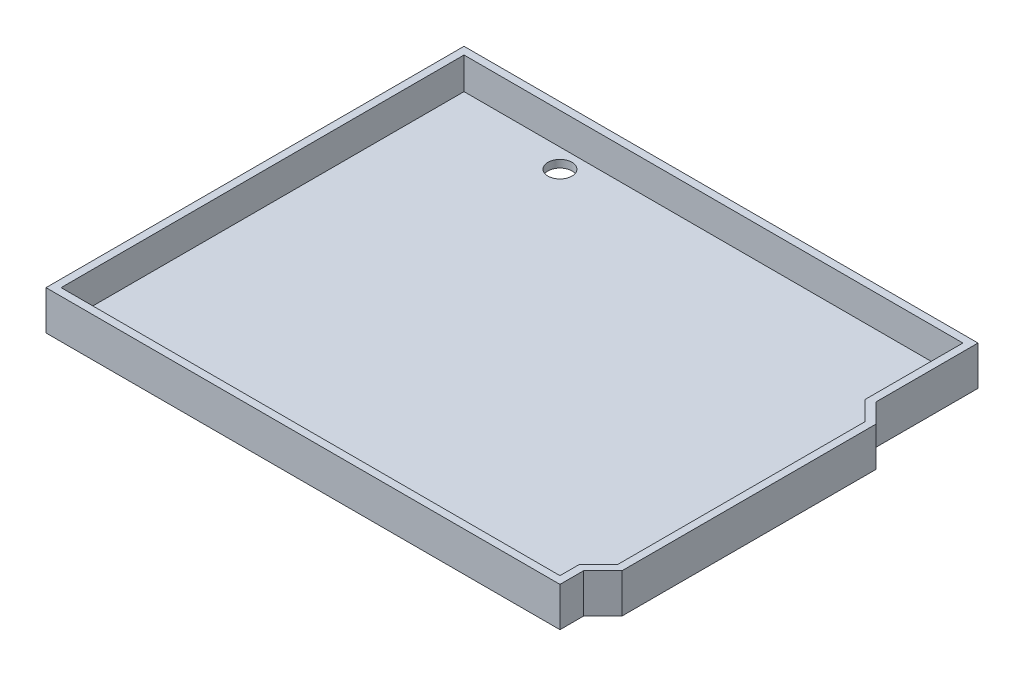
ISO-10303-21;
HEADER;
FILE_DESCRIPTION(('STEP AP214'),'2;1');
FILE_NAME('part.step','',(''),(''),'','','');
FILE_SCHEMA(('AUTOMOTIVE_DESIGN { 1 0 10303 214 1 1 1 1 }'));
ENDSEC;
DATA;
#1=APPLICATION_CONTEXT('core data for automotive mechanical design processes');
#2=APPLICATION_PROTOCOL_DEFINITION('international standard','automotive_design',2000,#1);
#3=PRODUCT_CONTEXT('',#1,'mechanical');
#4=PRODUCT('Part','Part','',(#3));
#5=PRODUCT_RELATED_PRODUCT_CATEGORY('part','',(#4));
#6=PRODUCT_DEFINITION_FORMATION('','',#4);
#7=PRODUCT_DEFINITION_CONTEXT('part definition',#1,'design');
#8=PRODUCT_DEFINITION('design','',#6,#7);
#9=PRODUCT_DEFINITION_SHAPE('','',#8);
#10=(LENGTH_UNIT() NAMED_UNIT(*) SI_UNIT(.MILLI.,.METRE.));
#11=(NAMED_UNIT(*) PLANE_ANGLE_UNIT() SI_UNIT($,.RADIAN.));
#12=(NAMED_UNIT(*) SI_UNIT($,.STERADIAN.) SOLID_ANGLE_UNIT());
#13=UNCERTAINTY_MEASURE_WITH_UNIT(LENGTH_MEASURE(1.E-05),#10,'distance_accuracy_value','');
#14=(GEOMETRIC_REPRESENTATION_CONTEXT(3) GLOBAL_UNCERTAINTY_ASSIGNED_CONTEXT((#13)) GLOBAL_UNIT_ASSIGNED_CONTEXT((#10,
#11,#12)) REPRESENTATION_CONTEXT('',''));
#15=CARTESIAN_POINT('',(0.,0.,0.));
#16=DIRECTION('',(0.,0.,1.));
#17=DIRECTION('',(1.,0.,0.));
#18=AXIS2_PLACEMENT_3D('',#15,#16,#17);
#19=CARTESIAN_POINT('',(33.02,-5.2,19.05));
#20=DIRECTION('',(0.,1.,0.));
#21=DIRECTION('',(0.,0.,1.));
#22=AXIS2_PLACEMENT_3D('',#19,#20,#21);
#23=CYLINDRICAL_SURFACE('',#22,1.59);
#24=CARTESIAN_POINT('',(33.02,-5.2,19.05));
#25=DIRECTION('',(0.,1.,0.));
#26=DIRECTION('',(0.,0.,1.));
#27=AXIS2_PLACEMENT_3D('',#24,#25,#26);
#28=CIRCLE('',#27,1.59);
#29=CARTESIAN_POINT('',(33.02,-5.2,20.64));
#30=VERTEX_POINT('',#29);
#31=EDGE_CURVE('E212',#30,#30,#28,.T.);
#32=ORIENTED_EDGE('',*,*,#31,.F.);
#33=EDGE_LOOP('',(#32));
#34=FACE_BOUND('',#33,.T.);
#35=CARTESIAN_POINT('',(33.02,-4.2,19.05));
#36=DIRECTION('',(0.,1.,0.));
#37=DIRECTION('',(0.,0.,1.));
#38=AXIS2_PLACEMENT_3D('',#35,#36,#37);
#39=CIRCLE('',#38,1.59);
#40=CARTESIAN_POINT('',(33.02,-4.2,20.64));
#41=VERTEX_POINT('',#40);
#42=EDGE_CURVE('E291',#41,#41,#39,.T.);
#43=ORIENTED_EDGE('',*,*,#42,.T.);
#44=EDGE_LOOP('',(#43));
#45=FACE_BOUND('',#44,.T.);
#46=ADVANCED_FACE('F45',(#34,#45),#23,.F.);
#47=CARTESIAN_POINT('',(33.02,-5.2,-8.89));
#48=DIRECTION('',(0.,1.,0.));
#49=DIRECTION('',(0.,0.,1.));
#50=AXIS2_PLACEMENT_3D('',#47,#48,#49);
#51=CYLINDRICAL_SURFACE('',#50,1.59);
#52=CARTESIAN_POINT('',(33.02,-5.2,-8.89));
#53=DIRECTION('',(0.,1.,0.));
#54=DIRECTION('',(0.,0.,1.));
#55=AXIS2_PLACEMENT_3D('',#52,#53,#54);
#56=CIRCLE('',#55,1.59);
#57=CARTESIAN_POINT('',(33.02,-5.2,-7.3));
#58=VERTEX_POINT('',#57);
#59=EDGE_CURVE('E215',#58,#58,#56,.T.);
#60=ORIENTED_EDGE('',*,*,#59,.F.);
#61=EDGE_LOOP('',(#60));
#62=FACE_BOUND('',#61,.T.);
#63=CARTESIAN_POINT('',(33.02,-4.2,-8.89));
#64=DIRECTION('',(0.,1.,0.));
#65=DIRECTION('',(0.,0.,1.));
#66=AXIS2_PLACEMENT_3D('',#63,#64,#65);
#67=CIRCLE('',#66,1.59);
#68=CARTESIAN_POINT('',(33.02,-4.2,-7.3));
#69=VERTEX_POINT('',#68);
#70=EDGE_CURVE('E294',#69,#69,#67,.T.);
#71=ORIENTED_EDGE('',*,*,#70,.T.);
#72=EDGE_LOOP('',(#71));
#73=FACE_BOUND('',#72,.T.);
#74=ADVANCED_FACE('F381',(#62,#73),#51,.F.);
#75=CARTESIAN_POINT('',(-17.78,-5.2,-24.13));
#76=DIRECTION('',(0.,1.,0.));
#77=DIRECTION('',(0.,0.,1.));
#78=AXIS2_PLACEMENT_3D('',#75,#76,#77);
#79=CYLINDRICAL_SURFACE('',#78,1.59);
#80=CARTESIAN_POINT('',(-17.78,-5.2,-24.13));
#81=DIRECTION('',(0.,1.,0.));
#82=DIRECTION('',(0.,0.,1.));
#83=AXIS2_PLACEMENT_3D('',#80,#81,#82);
#84=CIRCLE('',#83,1.59);
#85=CARTESIAN_POINT('',(-17.78,-5.2,-22.54));
#86=VERTEX_POINT('',#85);
#87=EDGE_CURVE('E218',#86,#86,#84,.T.);
#88=ORIENTED_EDGE('',*,*,#87,.F.);
#89=EDGE_LOOP('',(#88));
#90=FACE_BOUND('',#89,.T.);
#91=CARTESIAN_POINT('',(-17.78,-4.2,-24.13));
#92=DIRECTION('',(0.,1.,0.));
#93=DIRECTION('',(0.,0.,1.));
#94=AXIS2_PLACEMENT_3D('',#91,#92,#93);
#95=CIRCLE('',#94,1.59);
#96=CARTESIAN_POINT('',(-17.78,-4.2,-22.54));
#97=VERTEX_POINT('',#96);
#98=EDGE_CURVE('E297',#97,#97,#95,.T.);
#99=ORIENTED_EDGE('',*,*,#98,.T.);
#100=EDGE_LOOP('',(#99));
#101=FACE_BOUND('',#100,.T.);
#102=ADVANCED_FACE('F387',(#90,#101),#79,.F.);
#103=CARTESIAN_POINT('',(-19.05,-5.2,24.13));
#104=DIRECTION('',(0.,1.,0.));
#105=DIRECTION('',(0.,0.,1.));
#106=AXIS2_PLACEMENT_3D('',#103,#104,#105);
#107=CYLINDRICAL_SURFACE('',#106,1.59);
#108=CARTESIAN_POINT('',(-19.05,-5.2,24.13));
#109=DIRECTION('',(0.,1.,0.));
#110=DIRECTION('',(0.,0.,1.));
#111=AXIS2_PLACEMENT_3D('',#108,#109,#110);
#112=CIRCLE('',#111,1.59);
#113=CARTESIAN_POINT('',(-19.05,-5.2,25.72));
#114=VERTEX_POINT('',#113);
#115=EDGE_CURVE('E173',#114,#114,#112,.T.);
#116=ORIENTED_EDGE('',*,*,#115,.F.);
#117=EDGE_LOOP('',(#116));
#118=FACE_BOUND('',#117,.T.);
#119=CARTESIAN_POINT('',(-19.05,-4.2,24.13));
#120=DIRECTION('',(0.,1.,0.));
#121=DIRECTION('',(0.,0.,1.));
#122=AXIS2_PLACEMENT_3D('',#119,#120,#121);
#123=CIRCLE('',#122,1.59);
#124=CARTESIAN_POINT('',(-19.05,-4.2,25.72));
#125=VERTEX_POINT('',#124);
#126=EDGE_CURVE('E248',#125,#125,#123,.T.);
#127=ORIENTED_EDGE('',*,*,#126,.T.);
#128=EDGE_LOOP('',(#127));
#129=FACE_BOUND('',#128,.T.);
#130=ADVANCED_FACE('F47',(#118,#129),#107,.F.);
#131=CARTESIAN_POINT('',(0.,0.,0.));
#132=DIRECTION('',(0.,1.,0.));
#133=DIRECTION('',(0.,0.,1.));
#134=AXIS2_PLACEMENT_3D('',#131,#132,#133);
#135=PLANE('',#134);
#136=DIRECTION('',(0.,0.,1.));
#137=VECTOR('',#136,1.);
#138=CARTESIAN_POINT('',(34.02,0.,0.));
#139=LINE('',#138,#137);
#140=CARTESIAN_POINT('',(34.02,0.,-27.67));
#141=VERTEX_POINT('',#140);
#142=CARTESIAN_POINT('',(34.02,0.,-14.1342135623731));
#143=VERTEX_POINT('',#142);
#144=EDGE_CURVE('E155',#141,#143,#139,.T.);
#145=ORIENTED_EDGE('',*,*,#144,.F.);
#146=DIRECTION('',(1.,0.,0.));
#147=VECTOR('',#146,1.);
#148=CARTESIAN_POINT('',(0.,0.,-27.67));
#149=LINE('',#148,#147);
#150=CARTESIAN_POINT('',(-34.02,0.,-27.67));
#151=VERTEX_POINT('',#150);
#152=EDGE_CURVE('E158',#151,#141,#149,.T.);
#153=ORIENTED_EDGE('',*,*,#152,.F.);
#154=DIRECTION('',(0.,0.,1.));
#155=VECTOR('',#154,1.);
#156=CARTESIAN_POINT('',(-34.02,0.,0.));
#157=LINE('',#156,#155);
#158=CARTESIAN_POINT('',(-34.02,0.,27.67));
#159=VERTEX_POINT('',#158);
#160=EDGE_CURVE('E161',#151,#159,#157,.T.);
#161=ORIENTED_EDGE('',*,*,#160,.T.);
#162=DIRECTION('',(1.,0.,0.));
#163=VECTOR('',#162,1.);
#164=CARTESIAN_POINT('',(0.,0.,27.67));
#165=LINE('',#164,#163);
#166=CARTESIAN_POINT('',(34.02,0.,27.67));
#167=VERTEX_POINT('',#166);
#168=EDGE_CURVE('E164',#159,#167,#165,.T.);
#169=ORIENTED_EDGE('',*,*,#168,.T.);
#170=DIRECTION('',(0.,0.,-1.));
#171=VECTOR('',#170,1.);
#172=CARTESIAN_POINT('',(34.02,0.,0.));
#173=LINE('',#172,#171);
#174=CARTESIAN_POINT('',(34.02,0.,24.5442135623731));
#175=VERTEX_POINT('',#174);
#176=EDGE_CURVE('E167',#167,#175,#173,.T.);
#177=ORIENTED_EDGE('',*,*,#176,.T.);
#178=DIRECTION('',(0.707106781186544,0.,-0.707106781186551));
#179=VECTOR('',#178,1.);
#180=CARTESIAN_POINT('',(29.2821067811867,0.,29.2821067811864));
#181=LINE('',#180,#179);
#182=CARTESIAN_POINT('',(36.56,0.,22.0042135623731));
#183=VERTEX_POINT('',#182);
#184=EDGE_CURVE('E170',#175,#183,#181,.T.);
#185=ORIENTED_EDGE('',*,*,#184,.T.);
#186=DIRECTION('',(0.,0.,-1.));
#187=VECTOR('',#186,1.);
#188=CARTESIAN_POINT('',(36.56,0.,0.));
#189=LINE('',#188,#187);
#190=CARTESIAN_POINT('',(36.56,0.,-11.5942135623731));
#191=VERTEX_POINT('',#190);
#192=EDGE_CURVE('E135',#183,#191,#189,.T.);
#193=ORIENTED_EDGE('',*,*,#192,.T.);
#194=DIRECTION('',(0.707106781186551,0.,0.707106781186544));
#195=VECTOR('',#194,1.);
#196=CARTESIAN_POINT('',(24.0771067811864,0.,-24.0771067811866));
#197=LINE('',#196,#195);
#198=EDGE_CURVE('E104',#143,#191,#197,.T.);
#199=ORIENTED_EDGE('',*,*,#198,.F.);
#200=EDGE_LOOP('',(#145,#153,#161,#169,#177,#185,#193,#199));
#201=FACE_BOUND('',#200,.T.);
#202=DIRECTION('',(0.,0.,1.));
#203=VECTOR('',#202,1.);
#204=CARTESIAN_POINT('',(33.02,0.,0.));
#205=LINE('',#204,#203);
#206=CARTESIAN_POINT('',(33.02,0.,-26.67));
#207=VERTEX_POINT('',#206);
#208=CARTESIAN_POINT('',(33.02,0.,-13.72));
#209=VERTEX_POINT('',#208);
#210=EDGE_CURVE('E264',#207,#209,#205,.T.);
#211=ORIENTED_EDGE('',*,*,#210,.T.);
#212=DIRECTION('',(0.70710678118655,0.,0.707106781186545));
#213=VECTOR('',#212,1.);
#214=CARTESIAN_POINT('',(23.3699999999999,0.,-23.37));
#215=LINE('',#214,#213);
#216=CARTESIAN_POINT('',(35.56,0.,-11.18));
#217=VERTEX_POINT('',#216);
#218=EDGE_CURVE('E62',#209,#217,#215,.T.);
#219=ORIENTED_EDGE('',*,*,#218,.T.);
#220=DIRECTION('',(0.,0.,-1.));
#221=VECTOR('',#220,1.);
#222=CARTESIAN_POINT('',(35.56,0.,0.));
#223=LINE('',#222,#221);
#224=CARTESIAN_POINT('',(35.56,0.,21.59));
#225=VERTEX_POINT('',#224);
#226=EDGE_CURVE('E245',#225,#217,#223,.T.);
#227=ORIENTED_EDGE('',*,*,#226,.F.);
#228=DIRECTION('',(0.707106781186545,0.,-0.70710678118655));
#229=VECTOR('',#228,1.);
#230=CARTESIAN_POINT('',(28.5750000000001,0.,28.5749999999999));
#231=LINE('',#230,#229);
#232=CARTESIAN_POINT('',(33.02,0.,24.13));
#233=VERTEX_POINT('',#232);
#234=EDGE_CURVE('E249',#233,#225,#231,.T.);
#235=ORIENTED_EDGE('',*,*,#234,.F.);
#236=DIRECTION('',(0.,0.,-1.));
#237=VECTOR('',#236,1.);
#238=CARTESIAN_POINT('',(33.02,0.,0.));
#239=LINE('',#238,#237);
#240=CARTESIAN_POINT('',(33.02,0.,26.67));
#241=VERTEX_POINT('',#240);
#242=EDGE_CURVE('E252',#241,#233,#239,.T.);
#243=ORIENTED_EDGE('',*,*,#242,.F.);
#244=DIRECTION('',(1.,0.,0.));
#245=VECTOR('',#244,1.);
#246=CARTESIAN_POINT('',(0.,0.,26.67));
#247=LINE('',#246,#245);
#248=CARTESIAN_POINT('',(-33.02,0.,26.67));
#249=VERTEX_POINT('',#248);
#250=EDGE_CURVE('E255',#249,#241,#247,.T.);
#251=ORIENTED_EDGE('',*,*,#250,.F.);
#252=DIRECTION('',(0.,0.,1.));
#253=VECTOR('',#252,1.);
#254=CARTESIAN_POINT('',(-33.02,0.,0.));
#255=LINE('',#254,#253);
#256=CARTESIAN_POINT('',(-33.02,0.,-26.67));
#257=VERTEX_POINT('',#256);
#258=EDGE_CURVE('E258',#257,#249,#255,.T.);
#259=ORIENTED_EDGE('',*,*,#258,.F.);
#260=DIRECTION('',(1.,0.,0.));
#261=VECTOR('',#260,1.);
#262=CARTESIAN_POINT('',(0.,0.,-26.67));
#263=LINE('',#262,#261);
#264=EDGE_CURVE('E261',#257,#207,#263,.T.);
#265=ORIENTED_EDGE('',*,*,#264,.T.);
#266=EDGE_LOOP('',(#211,#219,#227,#235,#243,#251,#259,#265));
#267=FACE_BOUND('',#266,.T.);
#268=ADVANCED_FACE('F189',(#201,#267),#135,.T.);
#269=CARTESIAN_POINT('',(34.02,-5.2,0.));
#270=DIRECTION('',(-1.,0.,0.));
#271=DIRECTION('',(0.,0.,1.));
#272=AXIS2_PLACEMENT_3D('',#269,#270,#271);
#273=PLANE('',#272);
#274=ORIENTED_EDGE('',*,*,#144,.T.);
#275=DIRECTION('',(0.,1.,0.));
#276=VECTOR('',#275,1.);
#277=CARTESIAN_POINT('',(34.02,-5.2,-14.1342135623731));
#278=LINE('',#277,#276);
#279=CARTESIAN_POINT('',(34.02,-5.2,-14.1342135623731));
#280=VERTEX_POINT('',#279);
#281=EDGE_CURVE('E12',#280,#143,#278,.T.);
#282=ORIENTED_EDGE('',*,*,#281,.F.);
#283=DIRECTION('',(0.,0.,1.));
#284=VECTOR('',#283,1.);
#285=CARTESIAN_POINT('',(34.02,-5.2,0.));
#286=LINE('',#285,#284);
#287=CARTESIAN_POINT('',(34.02,-5.2,-27.67));
#288=VERTEX_POINT('',#287);
#289=EDGE_CURVE('E188',#288,#280,#286,.T.);
#290=ORIENTED_EDGE('',*,*,#289,.F.);
#291=DIRECTION('',(0.,1.,0.));
#292=VECTOR('',#291,1.);
#293=CARTESIAN_POINT('',(34.02,-5.2,-27.67));
#294=LINE('',#293,#292);
#295=EDGE_CURVE('E49',#288,#141,#294,.T.);
#296=ORIENTED_EDGE('',*,*,#295,.T.);
#297=EDGE_LOOP('',(#274,#282,#290,#296));
#298=FACE_BOUND('',#297,.T.);
#299=ADVANCED_FACE('F186',(#298),#273,.F.);
#300=CARTESIAN_POINT('',(24.0771067811864,-5.2,-24.0771067811866));
#301=DIRECTION('',(-0.707106781186544,0.,0.707106781186551));
#302=DIRECTION('',(0.707106781186551,0.,0.707106781186544));
#303=AXIS2_PLACEMENT_3D('',#300,#301,#302);
#304=PLANE('',#303);
#305=ORIENTED_EDGE('',*,*,#198,.T.);
#306=DIRECTION('',(0.,1.,0.));
#307=VECTOR('',#306,1.);
#308=CARTESIAN_POINT('',(36.56,-5.2,-11.5942135623731));
#309=LINE('',#308,#307);
#310=CARTESIAN_POINT('',(36.56,-5.2,-11.5942135623731));
#311=VERTEX_POINT('',#310);
#312=EDGE_CURVE('E54',#311,#191,#309,.T.);
#313=ORIENTED_EDGE('',*,*,#312,.F.);
#314=DIRECTION('',(0.707106781186551,0.,0.707106781186544));
#315=VECTOR('',#314,1.);
#316=CARTESIAN_POINT('',(24.0771067811864,-5.2,-24.0771067811866));
#317=LINE('',#316,#315);
#318=EDGE_CURVE('E70',#280,#311,#317,.T.);
#319=ORIENTED_EDGE('',*,*,#318,.F.);
#320=ORIENTED_EDGE('',*,*,#281,.T.);
#321=EDGE_LOOP('',(#305,#313,#319,#320));
#322=FACE_BOUND('',#321,.T.);
#323=ADVANCED_FACE('F419',(#322),#304,.F.);
#324=CARTESIAN_POINT('',(36.56,-5.2,0.));
#325=DIRECTION('',(1.,0.,0.));
#326=DIRECTION('',(0.,0.,-1.));
#327=AXIS2_PLACEMENT_3D('',#324,#325,#326);
#328=PLANE('',#327);
#329=ORIENTED_EDGE('',*,*,#192,.F.);
#330=DIRECTION('',(0.,1.,0.));
#331=VECTOR('',#330,1.);
#332=CARTESIAN_POINT('',(36.56,-5.2,22.0042135623731));
#333=LINE('',#332,#331);
#334=CARTESIAN_POINT('',(36.56,-5.2,22.0042135623731));
#335=VERTEX_POINT('',#334);
#336=EDGE_CURVE('E131',#335,#183,#333,.T.);
#337=ORIENTED_EDGE('',*,*,#336,.F.);
#338=DIRECTION('',(0.,0.,-1.));
#339=VECTOR('',#338,1.);
#340=CARTESIAN_POINT('',(36.56,-5.2,0.));
#341=LINE('',#340,#339);
#342=EDGE_CURVE('E134',#335,#311,#341,.T.);
#343=ORIENTED_EDGE('',*,*,#342,.T.);
#344=ORIENTED_EDGE('',*,*,#312,.T.);
#345=EDGE_LOOP('',(#329,#337,#343,#344));
#346=FACE_BOUND('',#345,.T.);
#347=ADVANCED_FACE('F133',(#346),#328,.T.);
#348=CARTESIAN_POINT('',(29.2821067811867,-5.2,29.2821067811864));
#349=DIRECTION('',(0.707106781186551,0.,0.707106781186544));
#350=DIRECTION('',(0.707106781186544,0.,-0.707106781186551));
#351=AXIS2_PLACEMENT_3D('',#348,#349,#350);
#352=PLANE('',#351);
#353=ORIENTED_EDGE('',*,*,#184,.F.);
#354=DIRECTION('',(0.,1.,0.));
#355=VECTOR('',#354,1.);
#356=CARTESIAN_POINT('',(34.02,-5.2,24.5442135623731));
#357=LINE('',#356,#355);
#358=CARTESIAN_POINT('',(34.02,-5.2,24.5442135623731));
#359=VERTEX_POINT('',#358);
#360=EDGE_CURVE('E140',#359,#175,#357,.T.);
#361=ORIENTED_EDGE('',*,*,#360,.F.);
#362=DIRECTION('',(0.707106781186544,0.,-0.707106781186551));
#363=VECTOR('',#362,1.);
#364=CARTESIAN_POINT('',(29.2821067811867,-5.2,29.2821067811864));
#365=LINE('',#364,#363);
#366=EDGE_CURVE('E145',#359,#335,#365,.T.);
#367=ORIENTED_EDGE('',*,*,#366,.T.);
#368=ORIENTED_EDGE('',*,*,#336,.T.);
#369=EDGE_LOOP('',(#353,#361,#367,#368));
#370=FACE_BOUND('',#369,.T.);
#371=ADVANCED_FACE('F148',(#370),#352,.T.);
#372=CARTESIAN_POINT('',(34.02,-5.2,0.));
#373=DIRECTION('',(1.,0.,0.));
#374=DIRECTION('',(0.,0.,-1.));
#375=AXIS2_PLACEMENT_3D('',#372,#373,#374);
#376=PLANE('',#375);
#377=ORIENTED_EDGE('',*,*,#176,.F.);
#378=DIRECTION('',(0.,1.,0.));
#379=VECTOR('',#378,1.);
#380=CARTESIAN_POINT('',(34.02,-5.2,27.67));
#381=LINE('',#380,#379);
#382=CARTESIAN_POINT('',(34.02,-5.2,27.67));
#383=VERTEX_POINT('',#382);
#384=EDGE_CURVE('E177',#383,#167,#381,.T.);
#385=ORIENTED_EDGE('',*,*,#384,.F.);
#386=DIRECTION('',(0.,0.,-1.));
#387=VECTOR('',#386,1.);
#388=CARTESIAN_POINT('',(34.02,-5.2,0.));
#389=LINE('',#388,#387);
#390=EDGE_CURVE('E149',#383,#359,#389,.T.);
#391=ORIENTED_EDGE('',*,*,#390,.T.);
#392=ORIENTED_EDGE('',*,*,#360,.T.);
#393=EDGE_LOOP('',(#377,#385,#391,#392));
#394=FACE_BOUND('',#393,.T.);
#395=ADVANCED_FACE('F203',(#394),#376,.T.);
#396=CARTESIAN_POINT('',(0.,-5.2,27.67));
#397=DIRECTION('',(0.,0.,1.));
#398=DIRECTION('',(1.,0.,0.));
#399=AXIS2_PLACEMENT_3D('',#396,#397,#398);
#400=PLANE('',#399);
#401=ORIENTED_EDGE('',*,*,#168,.F.);
#402=DIRECTION('',(0.,1.,0.));
#403=VECTOR('',#402,1.);
#404=CARTESIAN_POINT('',(-34.02,-5.2,27.67));
#405=LINE('',#404,#403);
#406=CARTESIAN_POINT('',(-34.02,-5.2,27.67));
#407=VERTEX_POINT('',#406);
#408=EDGE_CURVE('E179',#407,#159,#405,.T.);
#409=ORIENTED_EDGE('',*,*,#408,.F.);
#410=DIRECTION('',(1.,0.,0.));
#411=VECTOR('',#410,1.);
#412=CARTESIAN_POINT('',(0.,-5.2,27.67));
#413=LINE('',#412,#411);
#414=EDGE_CURVE('E151',#407,#383,#413,.T.);
#415=ORIENTED_EDGE('',*,*,#414,.T.);
#416=ORIENTED_EDGE('',*,*,#384,.T.);
#417=EDGE_LOOP('',(#401,#409,#415,#416));
#418=FACE_BOUND('',#417,.T.);
#419=ADVANCED_FACE('F200',(#418),#400,.T.);
#420=CARTESIAN_POINT('',(-34.02,-5.2,0.));
#421=DIRECTION('',(-1.,0.,0.));
#422=DIRECTION('',(0.,0.,1.));
#423=AXIS2_PLACEMENT_3D('',#420,#421,#422);
#424=PLANE('',#423);
#425=ORIENTED_EDGE('',*,*,#160,.F.);
#426=DIRECTION('',(0.,1.,0.));
#427=VECTOR('',#426,1.);
#428=CARTESIAN_POINT('',(-34.02,-5.2,-27.67));
#429=LINE('',#428,#427);
#430=CARTESIAN_POINT('',(-34.02,-5.2,-27.67));
#431=VERTEX_POINT('',#430);
#432=EDGE_CURVE('E180',#431,#151,#429,.T.);
#433=ORIENTED_EDGE('',*,*,#432,.F.);
#434=DIRECTION('',(0.,0.,1.));
#435=VECTOR('',#434,1.);
#436=CARTESIAN_POINT('',(-34.02,-5.2,0.));
#437=LINE('',#436,#435);
#438=EDGE_CURVE('E196',#431,#407,#437,.T.);
#439=ORIENTED_EDGE('',*,*,#438,.T.);
#440=ORIENTED_EDGE('',*,*,#408,.T.);
#441=EDGE_LOOP('',(#425,#433,#439,#440));
#442=FACE_BOUND('',#441,.T.);
#443=ADVANCED_FACE('F193',(#442),#424,.T.);
#444=CARTESIAN_POINT('',(0.,-5.2,-27.67));
#445=DIRECTION('',(0.,0.,1.));
#446=DIRECTION('',(1.,0.,0.));
#447=AXIS2_PLACEMENT_3D('',#444,#445,#446);
#448=PLANE('',#447);
#449=ORIENTED_EDGE('',*,*,#152,.T.);
#450=ORIENTED_EDGE('',*,*,#295,.F.);
#451=DIRECTION('',(1.,0.,0.));
#452=VECTOR('',#451,1.);
#453=CARTESIAN_POINT('',(0.,-5.2,-27.67));
#454=LINE('',#453,#452);
#455=EDGE_CURVE('E111',#431,#288,#454,.T.);
#456=ORIENTED_EDGE('',*,*,#455,.F.);
#457=ORIENTED_EDGE('',*,*,#432,.T.);
#458=EDGE_LOOP('',(#449,#450,#456,#457));
#459=FACE_BOUND('',#458,.T.);
#460=ADVANCED_FACE('F405',(#459),#448,.F.);
#461=CARTESIAN_POINT('',(0.,-5.2,0.));
#462=DIRECTION('',(0.,1.,0.));
#463=DIRECTION('',(0.,0.,1.));
#464=AXIS2_PLACEMENT_3D('',#461,#462,#463);
#465=PLANE('',#464);
#466=ORIENTED_EDGE('',*,*,#115,.T.);
#467=EDGE_LOOP('',(#466));
#468=FACE_BOUND('',#467,.T.);
#469=ORIENTED_EDGE('',*,*,#87,.T.);
#470=EDGE_LOOP('',(#469));
#471=FACE_BOUND('',#470,.T.);
#472=ORIENTED_EDGE('',*,*,#59,.T.);
#473=EDGE_LOOP('',(#472));
#474=FACE_BOUND('',#473,.T.);
#475=ORIENTED_EDGE('',*,*,#31,.T.);
#476=EDGE_LOOP('',(#475));
#477=FACE_BOUND('',#476,.T.);
#478=ORIENTED_EDGE('',*,*,#289,.T.);
#479=ORIENTED_EDGE('',*,*,#318,.T.);
#480=ORIENTED_EDGE('',*,*,#342,.F.);
#481=ORIENTED_EDGE('',*,*,#366,.F.);
#482=ORIENTED_EDGE('',*,*,#390,.F.);
#483=ORIENTED_EDGE('',*,*,#414,.F.);
#484=ORIENTED_EDGE('',*,*,#438,.F.);
#485=ORIENTED_EDGE('',*,*,#455,.T.);
#486=EDGE_LOOP('',(#478,#479,#480,#481,#482,#483,#484,#485));
#487=FACE_BOUND('',#486,.T.);
#488=ADVANCED_FACE('F143',(#468,#471,#474,#477,#487),#465,.F.);
#489=CARTESIAN_POINT('',(23.3699999999999,-4.2,-23.37));
#490=DIRECTION('',(-0.707106781186545,0.,0.70710678118655));
#491=DIRECTION('',(0.70710678118655,0.,0.707106781186545));
#492=AXIS2_PLACEMENT_3D('',#489,#490,#491);
#493=PLANE('',#492);
#494=ORIENTED_EDGE('',*,*,#218,.F.);
#495=DIRECTION('',(0.,1.,0.));
#496=VECTOR('',#495,1.);
#497=CARTESIAN_POINT('',(33.02,-4.2,-13.72));
#498=LINE('',#497,#496);
#499=CARTESIAN_POINT('',(33.02,-4.2,-13.72));
#500=VERTEX_POINT('',#499);
#501=EDGE_CURVE('E223',#500,#209,#498,.T.);
#502=ORIENTED_EDGE('',*,*,#501,.F.);
#503=DIRECTION('',(0.70710678118655,0.,0.707106781186545));
#504=VECTOR('',#503,1.);
#505=CARTESIAN_POINT('',(23.3699999999999,-4.2,-23.37));
#506=LINE('',#505,#504);
#507=CARTESIAN_POINT('',(35.56,-4.2,-11.18));
#508=VERTEX_POINT('',#507);
#509=EDGE_CURVE('E288',#500,#508,#506,.T.);
#510=ORIENTED_EDGE('',*,*,#509,.T.);
#511=DIRECTION('',(0.,1.,0.));
#512=VECTOR('',#511,1.);
#513=CARTESIAN_POINT('',(35.56,-4.2,-11.18));
#514=LINE('',#513,#512);
#515=EDGE_CURVE('E159',#508,#217,#514,.T.);
#516=ORIENTED_EDGE('',*,*,#515,.T.);
#517=EDGE_LOOP('',(#494,#502,#510,#516));
#518=FACE_BOUND('',#517,.T.);
#519=ADVANCED_FACE('F323',(#518),#493,.T.);
#520=CARTESIAN_POINT('',(35.56,-4.2,0.));
#521=DIRECTION('',(1.,0.,0.));
#522=DIRECTION('',(0.,0.,-1.));
#523=AXIS2_PLACEMENT_3D('',#520,#521,#522);
#524=PLANE('',#523);
#525=ORIENTED_EDGE('',*,*,#226,.T.);
#526=ORIENTED_EDGE('',*,*,#515,.F.);
#527=DIRECTION('',(0.,0.,-1.));
#528=VECTOR('',#527,1.);
#529=CARTESIAN_POINT('',(35.56,-4.2,0.));
#530=LINE('',#529,#528);
#531=CARTESIAN_POINT('',(35.56,-4.2,21.59));
#532=VERTEX_POINT('',#531);
#533=EDGE_CURVE('E226',#532,#508,#530,.T.);
#534=ORIENTED_EDGE('',*,*,#533,.F.);
#535=DIRECTION('',(0.,1.,0.));
#536=VECTOR('',#535,1.);
#537=CARTESIAN_POINT('',(35.56,-4.2,21.59));
#538=LINE('',#537,#536);
#539=EDGE_CURVE('E241',#532,#225,#538,.T.);
#540=ORIENTED_EDGE('',*,*,#539,.T.);
#541=EDGE_LOOP('',(#525,#526,#534,#540));
#542=FACE_BOUND('',#541,.T.);
#543=ADVANCED_FACE('F327',(#542),#524,.F.);
#544=CARTESIAN_POINT('',(28.5750000000001,-4.2,28.5749999999999));
#545=DIRECTION('',(0.70710678118655,0.,0.707106781186545));
#546=DIRECTION('',(0.707106781186545,0.,-0.70710678118655));
#547=AXIS2_PLACEMENT_3D('',#544,#545,#546);
#548=PLANE('',#547);
#549=ORIENTED_EDGE('',*,*,#234,.T.);
#550=ORIENTED_EDGE('',*,*,#539,.F.);
#551=DIRECTION('',(0.707106781186545,0.,-0.70710678118655));
#552=VECTOR('',#551,1.);
#553=CARTESIAN_POINT('',(28.5750000000001,-4.2,28.5749999999999));
#554=LINE('',#553,#552);
#555=CARTESIAN_POINT('',(33.02,-4.2,24.13));
#556=VERTEX_POINT('',#555);
#557=EDGE_CURVE('E270',#556,#532,#554,.T.);
#558=ORIENTED_EDGE('',*,*,#557,.F.);
#559=DIRECTION('',(0.,1.,0.));
#560=VECTOR('',#559,1.);
#561=CARTESIAN_POINT('',(33.02,-4.2,24.13));
#562=LINE('',#561,#560);
#563=EDGE_CURVE('E238',#556,#233,#562,.T.);
#564=ORIENTED_EDGE('',*,*,#563,.T.);
#565=EDGE_LOOP('',(#549,#550,#558,#564));
#566=FACE_BOUND('',#565,.T.);
#567=ADVANCED_FACE('F352',(#566),#548,.F.);
#568=CARTESIAN_POINT('',(33.02,-4.2,0.));
#569=DIRECTION('',(1.,0.,0.));
#570=DIRECTION('',(0.,0.,-1.));
#571=AXIS2_PLACEMENT_3D('',#568,#569,#570);
#572=PLANE('',#571);
#573=ORIENTED_EDGE('',*,*,#242,.T.);
#574=ORIENTED_EDGE('',*,*,#563,.F.);
#575=DIRECTION('',(0.,0.,-1.));
#576=VECTOR('',#575,1.);
#577=CARTESIAN_POINT('',(33.02,-4.2,0.));
#578=LINE('',#577,#576);
#579=CARTESIAN_POINT('',(33.02,-4.2,26.67));
#580=VERTEX_POINT('',#579);
#581=EDGE_CURVE('E273',#580,#556,#578,.T.);
#582=ORIENTED_EDGE('',*,*,#581,.F.);
#583=DIRECTION('',(0.,1.,0.));
#584=VECTOR('',#583,1.);
#585=CARTESIAN_POINT('',(33.02,-4.2,26.67));
#586=LINE('',#585,#584);
#587=EDGE_CURVE('E235',#580,#241,#586,.T.);
#588=ORIENTED_EDGE('',*,*,#587,.T.);
#589=EDGE_LOOP('',(#573,#574,#582,#588));
#590=FACE_BOUND('',#589,.T.);
#591=ADVANCED_FACE('F357',(#590),#572,.F.);
#592=CARTESIAN_POINT('',(0.,-4.2,26.67));
#593=DIRECTION('',(0.,0.,1.));
#594=DIRECTION('',(1.,0.,0.));
#595=AXIS2_PLACEMENT_3D('',#592,#593,#594);
#596=PLANE('',#595);
#597=ORIENTED_EDGE('',*,*,#250,.T.);
#598=ORIENTED_EDGE('',*,*,#587,.F.);
#599=DIRECTION('',(1.,0.,0.));
#600=VECTOR('',#599,1.);
#601=CARTESIAN_POINT('',(0.,-4.2,26.67));
#602=LINE('',#601,#600);
#603=CARTESIAN_POINT('',(-33.02,-4.2,26.67));
#604=VERTEX_POINT('',#603);
#605=EDGE_CURVE('E276',#604,#580,#602,.T.);
#606=ORIENTED_EDGE('',*,*,#605,.F.);
#607=DIRECTION('',(0.,1.,0.));
#608=VECTOR('',#607,1.);
#609=CARTESIAN_POINT('',(-33.02,-4.2,26.67));
#610=LINE('',#609,#608);
#611=EDGE_CURVE('E232',#604,#249,#610,.T.);
#612=ORIENTED_EDGE('',*,*,#611,.T.);
#613=EDGE_LOOP('',(#597,#598,#606,#612));
#614=FACE_BOUND('',#613,.T.);
#615=ADVANCED_FACE('F361',(#614),#596,.F.);
#616=CARTESIAN_POINT('',(-33.02,-4.2,0.));
#617=DIRECTION('',(-1.,0.,0.));
#618=DIRECTION('',(0.,0.,1.));
#619=AXIS2_PLACEMENT_3D('',#616,#617,#618);
#620=PLANE('',#619);
#621=ORIENTED_EDGE('',*,*,#258,.T.);
#622=ORIENTED_EDGE('',*,*,#611,.F.);
#623=DIRECTION('',(0.,0.,1.));
#624=VECTOR('',#623,1.);
#625=CARTESIAN_POINT('',(-33.02,-4.2,0.));
#626=LINE('',#625,#624);
#627=CARTESIAN_POINT('',(-33.02,-4.2,-26.67));
#628=VERTEX_POINT('',#627);
#629=EDGE_CURVE('E279',#628,#604,#626,.T.);
#630=ORIENTED_EDGE('',*,*,#629,.F.);
#631=DIRECTION('',(0.,1.,0.));
#632=VECTOR('',#631,1.);
#633=CARTESIAN_POINT('',(-33.02,-4.2,-26.67));
#634=LINE('',#633,#632);
#635=EDGE_CURVE('E229',#628,#257,#634,.T.);
#636=ORIENTED_EDGE('',*,*,#635,.T.);
#637=EDGE_LOOP('',(#621,#622,#630,#636));
#638=FACE_BOUND('',#637,.T.);
#639=ADVANCED_FACE('F368',(#638),#620,.F.);
#640=CARTESIAN_POINT('',(0.,-4.2,-26.67));
#641=DIRECTION('',(0.,0.,1.));
#642=DIRECTION('',(1.,0.,0.));
#643=AXIS2_PLACEMENT_3D('',#640,#641,#642);
#644=PLANE('',#643);
#645=ORIENTED_EDGE('',*,*,#264,.F.);
#646=ORIENTED_EDGE('',*,*,#635,.F.);
#647=DIRECTION('',(1.,0.,0.));
#648=VECTOR('',#647,1.);
#649=CARTESIAN_POINT('',(0.,-4.2,-26.67));
#650=LINE('',#649,#648);
#651=CARTESIAN_POINT('',(33.02,-4.2,-26.67));
#652=VERTEX_POINT('',#651);
#653=EDGE_CURVE('E282',#628,#652,#650,.T.);
#654=ORIENTED_EDGE('',*,*,#653,.T.);
#655=DIRECTION('',(0.,1.,0.));
#656=VECTOR('',#655,1.);
#657=CARTESIAN_POINT('',(33.02,-4.2,-26.67));
#658=LINE('',#657,#656);
#659=EDGE_CURVE('E225',#652,#207,#658,.T.);
#660=ORIENTED_EDGE('',*,*,#659,.T.);
#661=EDGE_LOOP('',(#645,#646,#654,#660));
#662=FACE_BOUND('',#661,.T.);
#663=ADVANCED_FACE('F371',(#662),#644,.T.);
#664=CARTESIAN_POINT('',(33.02,-4.2,0.));
#665=DIRECTION('',(-1.,0.,0.));
#666=DIRECTION('',(0.,0.,1.));
#667=AXIS2_PLACEMENT_3D('',#664,#665,#666);
#668=PLANE('',#667);
#669=ORIENTED_EDGE('',*,*,#210,.F.);
#670=ORIENTED_EDGE('',*,*,#659,.F.);
#671=DIRECTION('',(0.,0.,1.));
#672=VECTOR('',#671,1.);
#673=CARTESIAN_POINT('',(33.02,-4.2,0.));
#674=LINE('',#673,#672);
#675=EDGE_CURVE('E285',#652,#500,#674,.T.);
#676=ORIENTED_EDGE('',*,*,#675,.T.);
#677=ORIENTED_EDGE('',*,*,#501,.T.);
#678=EDGE_LOOP('',(#669,#670,#676,#677));
#679=FACE_BOUND('',#678,.T.);
#680=ADVANCED_FACE('F307',(#679),#668,.T.);
#681=CARTESIAN_POINT('',(0.,-4.2,0.));
#682=DIRECTION('',(0.,1.,0.));
#683=DIRECTION('',(0.,0.,1.));
#684=AXIS2_PLACEMENT_3D('',#681,#682,#683);
#685=PLANE('',#684);
#686=ORIENTED_EDGE('',*,*,#126,.F.);
#687=EDGE_LOOP('',(#686));
#688=FACE_BOUND('',#687,.T.);
#689=ORIENTED_EDGE('',*,*,#98,.F.);
#690=EDGE_LOOP('',(#689));
#691=FACE_BOUND('',#690,.T.);
#692=ORIENTED_EDGE('',*,*,#70,.F.);
#693=EDGE_LOOP('',(#692));
#694=FACE_BOUND('',#693,.T.);
#695=ORIENTED_EDGE('',*,*,#42,.F.);
#696=EDGE_LOOP('',(#695));
#697=FACE_BOUND('',#696,.T.);
#698=ORIENTED_EDGE('',*,*,#509,.F.);
#699=ORIENTED_EDGE('',*,*,#675,.F.);
#700=ORIENTED_EDGE('',*,*,#653,.F.);
#701=ORIENTED_EDGE('',*,*,#629,.T.);
#702=ORIENTED_EDGE('',*,*,#605,.T.);
#703=ORIENTED_EDGE('',*,*,#581,.T.);
#704=ORIENTED_EDGE('',*,*,#557,.T.);
#705=ORIENTED_EDGE('',*,*,#533,.T.);
#706=EDGE_LOOP('',(#698,#699,#700,#701,#702,#703,#704,#705));
#707=FACE_BOUND('',#706,.T.);
#708=ADVANCED_FACE('F304',(#688,#691,#694,#697,#707),#685,.T.);
#709=CLOSED_SHELL('',(#46,#74,#102,#130,#268,#299,#323,#347,#371,#395,#419,#443,#460,#488,#519,
#543,#567,#591,#615,#639,#663,#680,#708));
#710=MANIFOLD_SOLID_BREP('B2',#709);
#711=ADVANCED_BREP_SHAPE_REPRESENTATION('',(#18,#710),#14);
#712=SHAPE_DEFINITION_REPRESENTATION(#9,#711);
ENDSEC;
END-ISO-10303-21;
